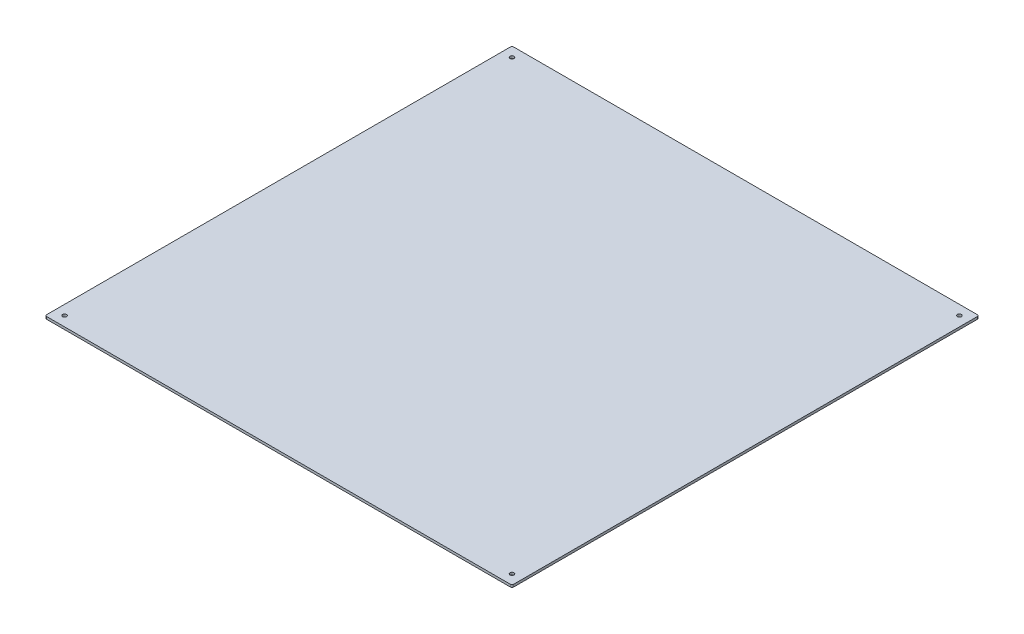
ISO-10303-21;
HEADER;
FILE_DESCRIPTION(('STEP AP214'),'2;1');
FILE_NAME('part.step','',(''),(''),'','','');
FILE_SCHEMA(('AUTOMOTIVE_DESIGN { 1 0 10303 214 1 1 1 1 }'));
ENDSEC;
DATA;
#1=APPLICATION_CONTEXT('core data for automotive mechanical design processes');
#2=APPLICATION_PROTOCOL_DEFINITION('international standard','automotive_design',2000,#1);
#3=PRODUCT_CONTEXT('',#1,'mechanical');
#4=PRODUCT('Part','Part','',(#3));
#5=PRODUCT_RELATED_PRODUCT_CATEGORY('part','',(#4));
#6=PRODUCT_DEFINITION_FORMATION('','',#4);
#7=PRODUCT_DEFINITION_CONTEXT('part definition',#1,'design');
#8=PRODUCT_DEFINITION('design','',#6,#7);
#9=PRODUCT_DEFINITION_SHAPE('','',#8);
#10=(LENGTH_UNIT() NAMED_UNIT(*) SI_UNIT(.MILLI.,.METRE.));
#11=(NAMED_UNIT(*) PLANE_ANGLE_UNIT() SI_UNIT($,.RADIAN.));
#12=(NAMED_UNIT(*) SI_UNIT($,.STERADIAN.) SOLID_ANGLE_UNIT());
#13=UNCERTAINTY_MEASURE_WITH_UNIT(LENGTH_MEASURE(1.E-05),#10,'distance_accuracy_value','');
#14=(GEOMETRIC_REPRESENTATION_CONTEXT(3) GLOBAL_UNCERTAINTY_ASSIGNED_CONTEXT((#13)) GLOBAL_UNIT_ASSIGNED_CONTEXT((#10,
#11,#12)) REPRESENTATION_CONTEXT('',''));
#15=CARTESIAN_POINT('',(0.,0.,0.));
#16=DIRECTION('',(0.,0.,1.));
#17=DIRECTION('',(1.,0.,0.));
#18=AXIS2_PLACEMENT_3D('',#15,#16,#17);
#19=CARTESIAN_POINT('',(-304.8,3.175,0.));
#20=DIRECTION('',(-1.,0.,0.));
#21=DIRECTION('',(0.,0.,1.));
#22=AXIS2_PLACEMENT_3D('',#19,#20,#21);
#23=PLANE('',#22);
#24=DIRECTION('',(0.,0.,-1.));
#25=VECTOR('',#24,1.);
#26=CARTESIAN_POINT('',(-304.8,3.175,0.));
#27=LINE('',#26,#25);
#28=CARTESIAN_POINT('',(-304.8,3.175,302.6918));
#29=VERTEX_POINT('',#28);
#30=CARTESIAN_POINT('',(-304.8,3.175,-302.6918));
#31=VERTEX_POINT('',#30);
#32=EDGE_CURVE('E159',#29,#31,#27,.T.);
#33=ORIENTED_EDGE('',*,*,#32,.T.);
#34=DIRECTION('',(0.,-1.,0.));
#35=VECTOR('',#34,1.);
#36=CARTESIAN_POINT('',(-304.8,0.,-302.6918));
#37=LINE('',#36,#35);
#38=CARTESIAN_POINT('',(-304.8,0.,-302.6918));
#39=VERTEX_POINT('',#38);
#40=EDGE_CURVE('E120',#31,#39,#37,.T.);
#41=ORIENTED_EDGE('',*,*,#40,.T.);
#42=DIRECTION('',(0.,0.,-1.));
#43=VECTOR('',#42,1.);
#44=CARTESIAN_POINT('',(-304.8,0.,0.));
#45=LINE('',#44,#43);
#46=CARTESIAN_POINT('',(-304.8,0.,302.6918));
#47=VERTEX_POINT('',#46);
#48=EDGE_CURVE('E104',#47,#39,#45,.T.);
#49=ORIENTED_EDGE('',*,*,#48,.F.);
#50=DIRECTION('',(0.,-1.,0.));
#51=VECTOR('',#50,1.);
#52=CARTESIAN_POINT('',(-304.8,3.175,302.6918));
#53=LINE('',#52,#51);
#54=EDGE_CURVE('E117',#47,#29,#53,.F.);
#55=ORIENTED_EDGE('',*,*,#54,.T.);
#56=EDGE_LOOP('',(#33,#41,#49,#55));
#57=FACE_BOUND('',#56,.T.);
#58=ADVANCED_FACE('F35',(#57),#23,.T.);
#59=CARTESIAN_POINT('',(0.,3.175,304.8));
#60=DIRECTION('',(0.,0.,1.));
#61=DIRECTION('',(1.,0.,0.));
#62=AXIS2_PLACEMENT_3D('',#59,#60,#61);
#63=PLANE('',#62);
#64=DIRECTION('',(-1.,0.,0.));
#65=VECTOR('',#64,1.);
#66=CARTESIAN_POINT('',(0.,3.175,304.8));
#67=LINE('',#66,#65);
#68=CARTESIAN_POINT('',(302.6918,3.175,304.8));
#69=VERTEX_POINT('',#68);
#70=CARTESIAN_POINT('',(-302.6918,3.175,304.8));
#71=VERTEX_POINT('',#70);
#72=EDGE_CURVE('E158',#69,#71,#67,.T.);
#73=ORIENTED_EDGE('',*,*,#72,.T.);
#74=DIRECTION('',(0.,-1.,0.));
#75=VECTOR('',#74,1.);
#76=CARTESIAN_POINT('',(-302.6918,3.175,304.8));
#77=LINE('',#76,#75);
#78=CARTESIAN_POINT('',(-302.6918,0.,304.8));
#79=VERTEX_POINT('',#78);
#80=EDGE_CURVE('E153',#71,#79,#77,.T.);
#81=ORIENTED_EDGE('',*,*,#80,.T.);
#82=DIRECTION('',(-1.,0.,0.));
#83=VECTOR('',#82,1.);
#84=CARTESIAN_POINT('',(0.,0.,304.8));
#85=LINE('',#84,#83);
#86=CARTESIAN_POINT('',(302.6918,0.,304.8));
#87=VERTEX_POINT('',#86);
#88=EDGE_CURVE('E106',#87,#79,#85,.T.);
#89=ORIENTED_EDGE('',*,*,#88,.F.);
#90=DIRECTION('',(0.,-1.,0.));
#91=VECTOR('',#90,1.);
#92=CARTESIAN_POINT('',(302.6918,3.175,304.8));
#93=LINE('',#92,#91);
#94=EDGE_CURVE('E151',#87,#69,#93,.F.);
#95=ORIENTED_EDGE('',*,*,#94,.T.);
#96=EDGE_LOOP('',(#73,#81,#89,#95));
#97=FACE_BOUND('',#96,.T.);
#98=ADVANCED_FACE('F156',(#97),#63,.T.);
#99=CARTESIAN_POINT('',(304.8,3.175,0.));
#100=DIRECTION('',(-1.,0.,0.));
#101=DIRECTION('',(0.,0.,1.));
#102=AXIS2_PLACEMENT_3D('',#99,#100,#101);
#103=PLANE('',#102);
#104=DIRECTION('',(0.,0.,-1.));
#105=VECTOR('',#104,1.);
#106=CARTESIAN_POINT('',(304.8,3.175,0.));
#107=LINE('',#106,#105);
#108=CARTESIAN_POINT('',(304.8,3.175,302.6918));
#109=VERTEX_POINT('',#108);
#110=CARTESIAN_POINT('',(304.8,3.175,-302.6918));
#111=VERTEX_POINT('',#110);
#112=EDGE_CURVE('E131',#109,#111,#107,.T.);
#113=ORIENTED_EDGE('',*,*,#112,.F.);
#114=DIRECTION('',(0.,-1.,0.));
#115=VECTOR('',#114,1.);
#116=CARTESIAN_POINT('',(304.8,0.,302.6918));
#117=LINE('',#116,#115);
#118=CARTESIAN_POINT('',(304.8,0.,302.6918));
#119=VERTEX_POINT('',#118);
#120=EDGE_CURVE('E11',#109,#119,#117,.T.);
#121=ORIENTED_EDGE('',*,*,#120,.T.);
#122=DIRECTION('',(0.,0.,-1.));
#123=VECTOR('',#122,1.);
#124=CARTESIAN_POINT('',(304.8,0.,0.));
#125=LINE('',#124,#123);
#126=CARTESIAN_POINT('',(304.8,0.,-302.6918));
#127=VERTEX_POINT('',#126);
#128=EDGE_CURVE('E165',#119,#127,#125,.T.);
#129=ORIENTED_EDGE('',*,*,#128,.T.);
#130=DIRECTION('',(0.,-1.,0.));
#131=VECTOR('',#130,1.);
#132=CARTESIAN_POINT('',(304.8,3.175,-302.6918));
#133=LINE('',#132,#131);
#134=EDGE_CURVE('E43',#127,#111,#133,.F.);
#135=ORIENTED_EDGE('',*,*,#134,.T.);
#136=EDGE_LOOP('',(#113,#121,#129,#135));
#137=FACE_BOUND('',#136,.T.);
#138=ADVANCED_FACE('F183',(#137),#103,.F.);
#139=CARTESIAN_POINT('',(0.,3.175,-304.8));
#140=DIRECTION('',(0.,0.,1.));
#141=DIRECTION('',(1.,0.,0.));
#142=AXIS2_PLACEMENT_3D('',#139,#140,#141);
#143=PLANE('',#142);
#144=DIRECTION('',(-1.,0.,0.));
#145=VECTOR('',#144,1.);
#146=CARTESIAN_POINT('',(0.,0.,-304.8));
#147=LINE('',#146,#145);
#148=CARTESIAN_POINT('',(302.6918,0.,-304.8));
#149=VERTEX_POINT('',#148);
#150=CARTESIAN_POINT('',(-302.6918,0.,-304.8));
#151=VERTEX_POINT('',#150);
#152=EDGE_CURVE('E134',#149,#151,#147,.T.);
#153=ORIENTED_EDGE('',*,*,#152,.T.);
#154=DIRECTION('',(0.,-1.,0.));
#155=VECTOR('',#154,1.);
#156=CARTESIAN_POINT('',(-302.6918,3.175,-304.8));
#157=LINE('',#156,#155);
#158=CARTESIAN_POINT('',(-302.6918,3.175,-304.8));
#159=VERTEX_POINT('',#158);
#160=EDGE_CURVE('E143',#151,#159,#157,.F.);
#161=ORIENTED_EDGE('',*,*,#160,.T.);
#162=DIRECTION('',(-1.,0.,0.));
#163=VECTOR('',#162,1.);
#164=CARTESIAN_POINT('',(0.,3.175,-304.8));
#165=LINE('',#164,#163);
#166=CARTESIAN_POINT('',(302.6918,3.175,-304.8));
#167=VERTEX_POINT('',#166);
#168=EDGE_CURVE('E126',#167,#159,#165,.T.);
#169=ORIENTED_EDGE('',*,*,#168,.F.);
#170=DIRECTION('',(0.,-1.,0.));
#171=VECTOR('',#170,1.);
#172=CARTESIAN_POINT('',(302.6918,3.175,-304.8));
#173=LINE('',#172,#171);
#174=EDGE_CURVE('E140',#167,#149,#173,.T.);
#175=ORIENTED_EDGE('',*,*,#174,.T.);
#176=EDGE_LOOP('',(#153,#161,#169,#175));
#177=FACE_BOUND('',#176,.T.);
#178=ADVANCED_FACE('F171',(#177),#143,.F.);
#179=CARTESIAN_POINT('',(0.,3.175,0.));
#180=DIRECTION('',(0.,1.,0.));
#181=DIRECTION('',(0.,0.,1.));
#182=AXIS2_PLACEMENT_3D('',#179,#180,#181);
#183=PLANE('',#182);
#184=CARTESIAN_POINT('',(-291.999999946,3.175,-291.999999946));
#185=DIRECTION('',(0.,-1.,0.));
#186=DIRECTION('',(0.,0.,-1.));
#187=AXIS2_PLACEMENT_3D('',#184,#185,#186);
#188=CIRCLE('',#187,2.60985000000002);
#189=CARTESIAN_POINT('',(-291.999999946,3.175,-294.609849946));
#190=VERTEX_POINT('',#189);
#191=EDGE_CURVE('E325',#190,#190,#188,.T.);
#192=ORIENTED_EDGE('',*,*,#191,.T.);
#193=EDGE_LOOP('',(#192));
#194=FACE_BOUND('',#193,.T.);
#195=CARTESIAN_POINT('',(-291.999999946,3.175,291.999999946));
#196=DIRECTION('',(0.,-1.,0.));
#197=DIRECTION('',(0.,0.,-1.));
#198=AXIS2_PLACEMENT_3D('',#195,#196,#197);
#199=CIRCLE('',#198,2.60985000000002);
#200=CARTESIAN_POINT('',(-291.999999946,3.175,289.390149946));
#201=VERTEX_POINT('',#200);
#202=EDGE_CURVE('E319',#201,#201,#199,.T.);
#203=ORIENTED_EDGE('',*,*,#202,.T.);
#204=EDGE_LOOP('',(#203));
#205=FACE_BOUND('',#204,.T.);
#206=CARTESIAN_POINT('',(291.999999946,3.175,291.999999946));
#207=DIRECTION('',(0.,-1.,0.));
#208=DIRECTION('',(0.,0.,-1.));
#209=AXIS2_PLACEMENT_3D('',#206,#207,#208);
#210=CIRCLE('',#209,2.60985000000002);
#211=CARTESIAN_POINT('',(291.999999946,3.175,289.390149946));
#212=VERTEX_POINT('',#211);
#213=EDGE_CURVE('E311',#212,#212,#210,.T.);
#214=ORIENTED_EDGE('',*,*,#213,.T.);
#215=EDGE_LOOP('',(#214));
#216=FACE_BOUND('',#215,.T.);
#217=CARTESIAN_POINT('',(291.999999946,3.175,-291.999999946));
#218=DIRECTION('',(0.,-1.,0.));
#219=DIRECTION('',(0.,0.,-1.));
#220=AXIS2_PLACEMENT_3D('',#217,#218,#219);
#221=CIRCLE('',#220,2.60985000000002);
#222=CARTESIAN_POINT('',(291.999999946,3.175,-294.609849946));
#223=VERTEX_POINT('',#222);
#224=EDGE_CURVE('E121',#223,#223,#221,.T.);
#225=ORIENTED_EDGE('',*,*,#224,.T.);
#226=EDGE_LOOP('',(#225));
#227=FACE_BOUND('',#226,.T.);
#228=ORIENTED_EDGE('',*,*,#168,.T.);
#229=CARTESIAN_POINT('',(-302.6918,3.175,-302.6918));
#230=DIRECTION('',(0.,1.,0.));
#231=DIRECTION('',(0.,0.,1.));
#232=AXIS2_PLACEMENT_3D('',#229,#230,#231);
#233=CIRCLE('',#232,2.1082);
#234=EDGE_CURVE('E149',#159,#31,#233,.T.);
#235=ORIENTED_EDGE('',*,*,#234,.T.);
#236=ORIENTED_EDGE('',*,*,#32,.F.);
#237=CARTESIAN_POINT('',(-302.6918,3.175,302.6918));
#238=DIRECTION('',(0.,1.,0.));
#239=DIRECTION('',(0.,0.,1.));
#240=AXIS2_PLACEMENT_3D('',#237,#238,#239);
#241=CIRCLE('',#240,2.1082);
#242=EDGE_CURVE('E125',#29,#71,#241,.T.);
#243=ORIENTED_EDGE('',*,*,#242,.T.);
#244=ORIENTED_EDGE('',*,*,#72,.F.);
#245=CARTESIAN_POINT('',(302.6918,3.175,302.6918));
#246=DIRECTION('',(0.,1.,0.));
#247=DIRECTION('',(0.,0.,1.));
#248=AXIS2_PLACEMENT_3D('',#245,#246,#247);
#249=CIRCLE('',#248,2.1082);
#250=EDGE_CURVE('E56',#69,#109,#249,.T.);
#251=ORIENTED_EDGE('',*,*,#250,.T.);
#252=ORIENTED_EDGE('',*,*,#112,.T.);
#253=CARTESIAN_POINT('',(302.6918,3.175,-302.6918));
#254=DIRECTION('',(0.,1.,0.));
#255=DIRECTION('',(0.,0.,1.));
#256=AXIS2_PLACEMENT_3D('',#253,#254,#255);
#257=CIRCLE('',#256,2.1082);
#258=EDGE_CURVE('E145',#111,#167,#257,.T.);
#259=ORIENTED_EDGE('',*,*,#258,.T.);
#260=EDGE_LOOP('',(#228,#235,#236,#243,#244,#251,#252,#259));
#261=FACE_BOUND('',#260,.T.);
#262=ADVANCED_FACE('F177',(#194,#205,#216,#227,#261),#183,.T.);
#263=CARTESIAN_POINT('',(0.,0.,0.));
#264=DIRECTION('',(0.,1.,0.));
#265=DIRECTION('',(0.,0.,1.));
#266=AXIS2_PLACEMENT_3D('',#263,#264,#265);
#267=PLANE('',#266);
#268=CARTESIAN_POINT('',(-291.999999946,0.,-291.999999946));
#269=DIRECTION('',(0.,-1.,0.));
#270=DIRECTION('',(0.,0.,-1.));
#271=AXIS2_PLACEMENT_3D('',#268,#269,#270);
#272=CIRCLE('',#271,2.60984999999997);
#273=CARTESIAN_POINT('',(-291.999999946,0.,-294.609849946));
#274=VERTEX_POINT('',#273);
#275=EDGE_CURVE('E328',#274,#274,#272,.T.);
#276=ORIENTED_EDGE('',*,*,#275,.F.);
#277=EDGE_LOOP('',(#276));
#278=FACE_BOUND('',#277,.T.);
#279=CARTESIAN_POINT('',(-291.999999946,0.,291.999999946));
#280=DIRECTION('',(0.,-1.,0.));
#281=DIRECTION('',(0.,0.,-1.));
#282=AXIS2_PLACEMENT_3D('',#279,#280,#281);
#283=CIRCLE('',#282,2.60984999999997);
#284=CARTESIAN_POINT('',(-291.999999946,0.,289.390149946));
#285=VERTEX_POINT('',#284);
#286=EDGE_CURVE('E322',#285,#285,#283,.T.);
#287=ORIENTED_EDGE('',*,*,#286,.F.);
#288=EDGE_LOOP('',(#287));
#289=FACE_BOUND('',#288,.T.);
#290=CARTESIAN_POINT('',(291.999999946,0.,291.999999946));
#291=DIRECTION('',(0.,-1.,0.));
#292=DIRECTION('',(0.,0.,-1.));
#293=AXIS2_PLACEMENT_3D('',#290,#291,#292);
#294=CIRCLE('',#293,2.60984999999997);
#295=CARTESIAN_POINT('',(291.999999946,0.,289.390149946));
#296=VERTEX_POINT('',#295);
#297=EDGE_CURVE('E314',#296,#296,#294,.T.);
#298=ORIENTED_EDGE('',*,*,#297,.F.);
#299=EDGE_LOOP('',(#298));
#300=FACE_BOUND('',#299,.T.);
#301=CARTESIAN_POINT('',(291.999999946,0.,-291.999999946));
#302=DIRECTION('',(0.,-1.,0.));
#303=DIRECTION('',(0.,0.,-1.));
#304=AXIS2_PLACEMENT_3D('',#301,#302,#303);
#305=CIRCLE('',#304,2.60984999999997);
#306=CARTESIAN_POINT('',(291.999999946,0.,-294.609849946));
#307=VERTEX_POINT('',#306);
#308=EDGE_CURVE('E309',#307,#307,#305,.T.);
#309=ORIENTED_EDGE('',*,*,#308,.F.);
#310=EDGE_LOOP('',(#309));
#311=FACE_BOUND('',#310,.T.);
#312=ORIENTED_EDGE('',*,*,#48,.T.);
#313=CARTESIAN_POINT('',(-302.6918,0.,-302.6918));
#314=DIRECTION('',(0.,1.,0.));
#315=DIRECTION('',(0.,0.,1.));
#316=AXIS2_PLACEMENT_3D('',#313,#314,#315);
#317=CIRCLE('',#316,2.1082);
#318=EDGE_CURVE('E111',#39,#151,#317,.F.);
#319=ORIENTED_EDGE('',*,*,#318,.T.);
#320=ORIENTED_EDGE('',*,*,#152,.F.);
#321=CARTESIAN_POINT('',(302.6918,0.,-302.6918));
#322=DIRECTION('',(0.,1.,0.));
#323=DIRECTION('',(0.,0.,1.));
#324=AXIS2_PLACEMENT_3D('',#321,#322,#323);
#325=CIRCLE('',#324,2.1082);
#326=EDGE_CURVE('E128',#149,#127,#325,.F.);
#327=ORIENTED_EDGE('',*,*,#326,.T.);
#328=ORIENTED_EDGE('',*,*,#128,.F.);
#329=CARTESIAN_POINT('',(302.6918,0.,302.6918));
#330=DIRECTION('',(0.,1.,0.));
#331=DIRECTION('',(0.,0.,1.));
#332=AXIS2_PLACEMENT_3D('',#329,#330,#331);
#333=CIRCLE('',#332,2.1082);
#334=EDGE_CURVE('E112',#119,#87,#333,.F.);
#335=ORIENTED_EDGE('',*,*,#334,.T.);
#336=ORIENTED_EDGE('',*,*,#88,.T.);
#337=CARTESIAN_POINT('',(-302.6918,0.,302.6918));
#338=DIRECTION('',(0.,1.,0.));
#339=DIRECTION('',(0.,0.,1.));
#340=AXIS2_PLACEMENT_3D('',#337,#338,#339);
#341=CIRCLE('',#340,2.1082);
#342=EDGE_CURVE('E101',#79,#47,#341,.F.);
#343=ORIENTED_EDGE('',*,*,#342,.T.);
#344=EDGE_LOOP('',(#312,#319,#320,#327,#328,#335,#336,#343));
#345=FACE_BOUND('',#344,.T.);
#346=ADVANCED_FACE('F103',(#278,#289,#300,#311,#345),#267,.F.);
#347=CARTESIAN_POINT('',(291.999999946,0.,-291.999999946));
#348=DIRECTION('',(0.,-1.,0.));
#349=DIRECTION('',(0.,0.,-1.));
#350=AXIS2_PLACEMENT_3D('',#347,#348,#349);
#351=CYLINDRICAL_SURFACE('',#350,2.60985);
#352=ORIENTED_EDGE('',*,*,#224,.F.);
#353=EDGE_LOOP('',(#352));
#354=FACE_BOUND('',#353,.T.);
#355=ORIENTED_EDGE('',*,*,#308,.T.);
#356=EDGE_LOOP('',(#355));
#357=FACE_BOUND('',#356,.T.);
#358=ADVANCED_FACE('F234',(#354,#357),#351,.F.);
#359=CARTESIAN_POINT('',(291.999999946,0.,291.999999946));
#360=DIRECTION('',(0.,-1.,0.));
#361=DIRECTION('',(0.,0.,-1.));
#362=AXIS2_PLACEMENT_3D('',#359,#360,#361);
#363=CYLINDRICAL_SURFACE('',#362,2.60985);
#364=ORIENTED_EDGE('',*,*,#213,.F.);
#365=EDGE_LOOP('',(#364));
#366=FACE_BOUND('',#365,.T.);
#367=ORIENTED_EDGE('',*,*,#297,.T.);
#368=EDGE_LOOP('',(#367));
#369=FACE_BOUND('',#368,.T.);
#370=ADVANCED_FACE('F283',(#366,#369),#363,.F.);
#371=CARTESIAN_POINT('',(-291.999999946,0.,291.999999946));
#372=DIRECTION('',(0.,-1.,0.));
#373=DIRECTION('',(0.,0.,-1.));
#374=AXIS2_PLACEMENT_3D('',#371,#372,#373);
#375=CYLINDRICAL_SURFACE('',#374,2.60985);
#376=ORIENTED_EDGE('',*,*,#202,.F.);
#377=EDGE_LOOP('',(#376));
#378=FACE_BOUND('',#377,.T.);
#379=ORIENTED_EDGE('',*,*,#286,.T.);
#380=EDGE_LOOP('',(#379));
#381=FACE_BOUND('',#380,.T.);
#382=ADVANCED_FACE('F273',(#378,#381),#375,.F.);
#383=CARTESIAN_POINT('',(-291.999999946,0.,-291.999999946));
#384=DIRECTION('',(0.,-1.,0.));
#385=DIRECTION('',(0.,0.,-1.));
#386=AXIS2_PLACEMENT_3D('',#383,#384,#385);
#387=CYLINDRICAL_SURFACE('',#386,2.60985);
#388=ORIENTED_EDGE('',*,*,#191,.F.);
#389=EDGE_LOOP('',(#388));
#390=FACE_BOUND('',#389,.T.);
#391=ORIENTED_EDGE('',*,*,#275,.T.);
#392=EDGE_LOOP('',(#391));
#393=FACE_BOUND('',#392,.T.);
#394=ADVANCED_FACE('F199',(#390,#393),#387,.F.);
#395=CARTESIAN_POINT('',(-302.6918,3.175,-302.6918));
#396=DIRECTION('',(0.,1.,0.));
#397=DIRECTION('',(0.,0.,1.));
#398=AXIS2_PLACEMENT_3D('',#395,#396,#397);
#399=CYLINDRICAL_SURFACE('',#398,2.1082);
#400=ORIENTED_EDGE('',*,*,#234,.F.);
#401=ORIENTED_EDGE('',*,*,#160,.F.);
#402=ORIENTED_EDGE('',*,*,#318,.F.);
#403=ORIENTED_EDGE('',*,*,#40,.F.);
#404=EDGE_LOOP('',(#400,#401,#402,#403));
#405=FACE_BOUND('',#404,.T.);
#406=ADVANCED_FACE('F176',(#405),#399,.T.);
#407=CARTESIAN_POINT('',(-302.6918,3.175,302.6918));
#408=DIRECTION('',(0.,-1.,0.));
#409=DIRECTION('',(0.,0.,-1.));
#410=AXIS2_PLACEMENT_3D('',#407,#408,#409);
#411=CYLINDRICAL_SURFACE('',#410,2.1082);
#412=ORIENTED_EDGE('',*,*,#242,.F.);
#413=ORIENTED_EDGE('',*,*,#54,.F.);
#414=ORIENTED_EDGE('',*,*,#342,.F.);
#415=ORIENTED_EDGE('',*,*,#80,.F.);
#416=EDGE_LOOP('',(#412,#413,#414,#415));
#417=FACE_BOUND('',#416,.T.);
#418=ADVANCED_FACE('F124',(#417),#411,.T.);
#419=CARTESIAN_POINT('',(302.6918,3.175,302.6918));
#420=DIRECTION('',(0.,1.,0.));
#421=DIRECTION('',(0.,0.,1.));
#422=AXIS2_PLACEMENT_3D('',#419,#420,#421);
#423=CYLINDRICAL_SURFACE('',#422,2.1082);
#424=ORIENTED_EDGE('',*,*,#250,.F.);
#425=ORIENTED_EDGE('',*,*,#94,.F.);
#426=ORIENTED_EDGE('',*,*,#334,.F.);
#427=ORIENTED_EDGE('',*,*,#120,.F.);
#428=EDGE_LOOP('',(#424,#425,#426,#427));
#429=FACE_BOUND('',#428,.T.);
#430=ADVANCED_FACE('F182',(#429),#423,.T.);
#431=CARTESIAN_POINT('',(302.6918,3.175,-302.6918));
#432=DIRECTION('',(0.,-1.,0.));
#433=DIRECTION('',(0.,0.,-1.));
#434=AXIS2_PLACEMENT_3D('',#431,#432,#433);
#435=CYLINDRICAL_SURFACE('',#434,2.1082);
#436=ORIENTED_EDGE('',*,*,#258,.F.);
#437=ORIENTED_EDGE('',*,*,#134,.F.);
#438=ORIENTED_EDGE('',*,*,#326,.F.);
#439=ORIENTED_EDGE('',*,*,#174,.F.);
#440=EDGE_LOOP('',(#436,#437,#438,#439));
#441=FACE_BOUND('',#440,.T.);
#442=ADVANCED_FACE('F37',(#441),#435,.T.);
#443=CLOSED_SHELL('',(#58,#98,#138,#178,#262,#346,#358,#370,#382,#394,#406,#418,#430,#442));
#444=MANIFOLD_SOLID_BREP('B2',#443);
#445=ADVANCED_BREP_SHAPE_REPRESENTATION('',(#18,#444),#14);
#446=SHAPE_DEFINITION_REPRESENTATION(#9,#445);
ENDSEC;
END-ISO-10303-21;
